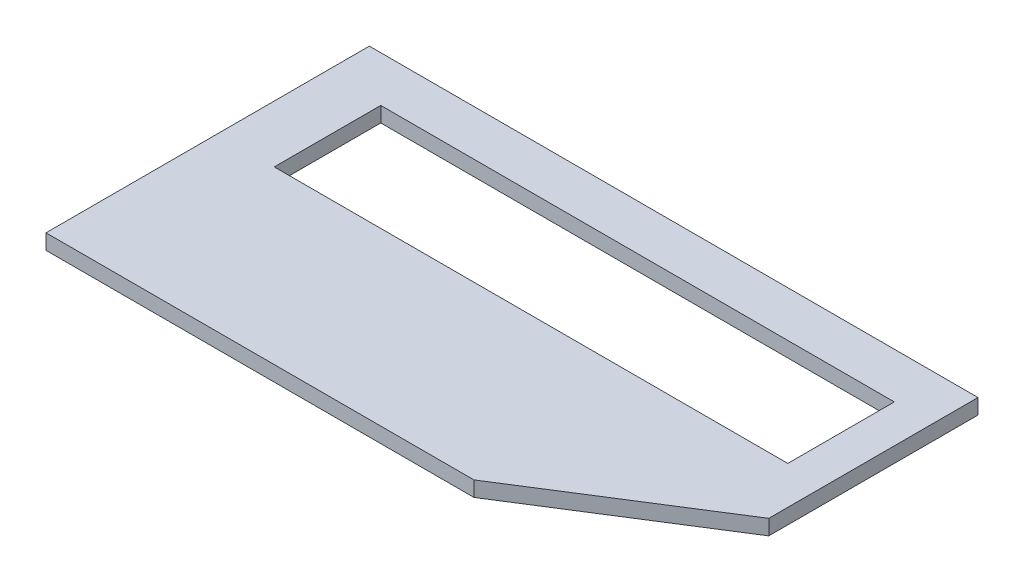
ISO-10303-21;
HEADER;
FILE_DESCRIPTION(('STEP AP214'),'2;1');
FILE_NAME('part.step','',(''),(''),'','','');
FILE_SCHEMA(('AUTOMOTIVE_DESIGN { 1 0 10303 214 1 1 1 1 }'));
ENDSEC;
DATA;
#1=APPLICATION_CONTEXT('core data for automotive mechanical design processes');
#2=APPLICATION_PROTOCOL_DEFINITION('international standard','automotive_design',2000,#1);
#3=PRODUCT_CONTEXT('',#1,'mechanical');
#4=PRODUCT('Part','Part','',(#3));
#5=PRODUCT_RELATED_PRODUCT_CATEGORY('part','',(#4));
#6=PRODUCT_DEFINITION_FORMATION('','',#4);
#7=PRODUCT_DEFINITION_CONTEXT('part definition',#1,'design');
#8=PRODUCT_DEFINITION('design','',#6,#7);
#9=PRODUCT_DEFINITION_SHAPE('','',#8);
#10=(LENGTH_UNIT() NAMED_UNIT(*) SI_UNIT(.MILLI.,.METRE.));
#11=(NAMED_UNIT(*) PLANE_ANGLE_UNIT() SI_UNIT($,.RADIAN.));
#12=(NAMED_UNIT(*) SI_UNIT($,.STERADIAN.) SOLID_ANGLE_UNIT());
#13=UNCERTAINTY_MEASURE_WITH_UNIT(LENGTH_MEASURE(1.E-05),#10,'distance_accuracy_value','');
#14=(GEOMETRIC_REPRESENTATION_CONTEXT(3) GLOBAL_UNCERTAINTY_ASSIGNED_CONTEXT((#13)) GLOBAL_UNIT_ASSIGNED_CONTEXT((#10,
#11,#12)) REPRESENTATION_CONTEXT('',''));
#15=CARTESIAN_POINT('',(0.,0.,0.));
#16=DIRECTION('',(0.,0.,1.));
#17=DIRECTION('',(1.,0.,0.));
#18=AXIS2_PLACEMENT_3D('',#15,#16,#17);
#19=CARTESIAN_POINT('',(0.,8.,0.));
#20=DIRECTION('',(0.,-1.,0.));
#21=DIRECTION('',(0.,0.,-1.));
#22=AXIS2_PLACEMENT_3D('',#19,#20,#21);
#23=PLANE('',#22);
#24=DIRECTION('',(0.,0.,1.));
#25=VECTOR('',#24,1.);
#26=CARTESIAN_POINT('',(0.,8.,0.));
#27=LINE('',#26,#25);
#28=CARTESIAN_POINT('',(0.,8.,-170.));
#29=VERTEX_POINT('',#28);
#30=CARTESIAN_POINT('',(0.,8.,0.));
#31=VERTEX_POINT('',#30);
#32=EDGE_CURVE('E159',#29,#31,#27,.T.);
#33=ORIENTED_EDGE('',*,*,#32,.T.);
#34=DIRECTION('',(1.,0.,0.));
#35=VECTOR('',#34,1.);
#36=CARTESIAN_POINT('',(0.,8.,0.));
#37=LINE('',#36,#35);
#38=CARTESIAN_POINT('',(225.,8.,0.));
#39=VERTEX_POINT('',#38);
#40=EDGE_CURVE('E163',#31,#39,#37,.T.);
#41=ORIENTED_EDGE('',*,*,#40,.T.);
#42=DIRECTION('',(0.845488903030971,0.,-0.533992991387982));
#43=VECTOR('',#42,1.);
#44=CARTESIAN_POINT('',(320.,8.,-60.));
#45=LINE('',#44,#43);
#46=CARTESIAN_POINT('',(320.,8.,-60.));
#47=VERTEX_POINT('',#46);
#48=EDGE_CURVE('E167',#39,#47,#45,.T.);
#49=ORIENTED_EDGE('',*,*,#48,.T.);
#50=DIRECTION('',(0.,0.,-1.));
#51=VECTOR('',#50,1.);
#52=CARTESIAN_POINT('',(320.,8.,-170.));
#53=LINE('',#52,#51);
#54=CARTESIAN_POINT('',(320.,8.,-170.));
#55=VERTEX_POINT('',#54);
#56=EDGE_CURVE('E170',#47,#55,#53,.T.);
#57=ORIENTED_EDGE('',*,*,#56,.T.);
#58=DIRECTION('',(-1.,0.,0.));
#59=VECTOR('',#58,1.);
#60=CARTESIAN_POINT('',(0.,8.,-170.));
#61=LINE('',#60,#59);
#62=EDGE_CURVE('E173',#55,#29,#61,.T.);
#63=ORIENTED_EDGE('',*,*,#62,.T.);
#64=EDGE_LOOP('',(#33,#41,#49,#57,#63));
#65=FACE_BOUND('',#64,.T.);
#66=DIRECTION('',(0.,0.,1.));
#67=VECTOR('',#66,1.);
#68=CARTESIAN_POINT('',(30.,8.,-146.));
#69=LINE('',#68,#67);
#70=CARTESIAN_POINT('',(30.,8.,-146.));
#71=VERTEX_POINT('',#70);
#72=CARTESIAN_POINT('',(30.,8.,-90.));
#73=VERTEX_POINT('',#72);
#74=EDGE_CURVE('E111',#71,#73,#69,.T.);
#75=ORIENTED_EDGE('',*,*,#74,.F.);
#76=DIRECTION('',(-1.,0.,0.));
#77=VECTOR('',#76,1.);
#78=CARTESIAN_POINT('',(30.,8.,-146.));
#79=LINE('',#78,#77);
#80=CARTESIAN_POINT('',(300.,8.,-146.));
#81=VERTEX_POINT('',#80);
#82=EDGE_CURVE('E137',#81,#71,#79,.T.);
#83=ORIENTED_EDGE('',*,*,#82,.F.);
#84=DIRECTION('',(0.,0.,-1.));
#85=VECTOR('',#84,1.);
#86=CARTESIAN_POINT('',(300.,8.,-146.));
#87=LINE('',#86,#85);
#88=CARTESIAN_POINT('',(300.,8.,-90.));
#89=VERTEX_POINT('',#88);
#90=EDGE_CURVE('E133',#89,#81,#87,.T.);
#91=ORIENTED_EDGE('',*,*,#90,.F.);
#92=DIRECTION('',(1.,0.,0.));
#93=VECTOR('',#92,1.);
#94=CARTESIAN_POINT('',(30.,8.,-90.));
#95=LINE('',#94,#93);
#96=EDGE_CURVE('E120',#73,#89,#95,.T.);
#97=ORIENTED_EDGE('',*,*,#96,.F.);
#98=EDGE_LOOP('',(#75,#83,#91,#97));
#99=FACE_BOUND('',#98,.T.);
#100=ADVANCED_FACE('F39',(#65,#99),#23,.F.);
#101=CARTESIAN_POINT('',(0.,0.,0.));
#102=DIRECTION('',(0.,-1.,0.));
#103=DIRECTION('',(0.,0.,-1.));
#104=AXIS2_PLACEMENT_3D('',#101,#102,#103);
#105=PLANE('',#104);
#106=DIRECTION('',(0.,0.,1.));
#107=VECTOR('',#106,1.);
#108=CARTESIAN_POINT('',(0.,0.,0.));
#109=LINE('',#108,#107);
#110=CARTESIAN_POINT('',(0.,0.,-170.));
#111=VERTEX_POINT('',#110);
#112=CARTESIAN_POINT('',(0.,0.,0.));
#113=VERTEX_POINT('',#112);
#114=EDGE_CURVE('E129',#111,#113,#109,.T.);
#115=ORIENTED_EDGE('',*,*,#114,.F.);
#116=DIRECTION('',(-1.,0.,0.));
#117=VECTOR('',#116,1.);
#118=CARTESIAN_POINT('',(0.,0.,-170.));
#119=LINE('',#118,#117);
#120=CARTESIAN_POINT('',(320.,0.,-170.));
#121=VERTEX_POINT('',#120);
#122=EDGE_CURVE('E164',#121,#111,#119,.T.);
#123=ORIENTED_EDGE('',*,*,#122,.F.);
#124=DIRECTION('',(0.,0.,-1.));
#125=VECTOR('',#124,1.);
#126=CARTESIAN_POINT('',(320.,0.,-170.));
#127=LINE('',#126,#125);
#128=CARTESIAN_POINT('',(320.,0.,-60.));
#129=VERTEX_POINT('',#128);
#130=EDGE_CURVE('E186',#129,#121,#127,.T.);
#131=ORIENTED_EDGE('',*,*,#130,.F.);
#132=DIRECTION('',(0.845488903030971,0.,-0.533992991387982));
#133=VECTOR('',#132,1.);
#134=CARTESIAN_POINT('',(320.,0.,-60.));
#135=LINE('',#134,#133);
#136=CARTESIAN_POINT('',(225.,0.,0.));
#137=VERTEX_POINT('',#136);
#138=EDGE_CURVE('E183',#137,#129,#135,.T.);
#139=ORIENTED_EDGE('',*,*,#138,.F.);
#140=DIRECTION('',(1.,0.,0.));
#141=VECTOR('',#140,1.);
#142=CARTESIAN_POINT('',(0.,0.,0.));
#143=LINE('',#142,#141);
#144=EDGE_CURVE('E180',#113,#137,#143,.T.);
#145=ORIENTED_EDGE('',*,*,#144,.F.);
#146=EDGE_LOOP('',(#115,#123,#131,#139,#145));
#147=FACE_BOUND('',#146,.T.);
#148=DIRECTION('',(-1.,0.,0.));
#149=VECTOR('',#148,1.);
#150=CARTESIAN_POINT('',(30.,0.,-146.));
#151=LINE('',#150,#149);
#152=CARTESIAN_POINT('',(300.,0.,-146.));
#153=VERTEX_POINT('',#152);
#154=CARTESIAN_POINT('',(30.,0.,-146.));
#155=VERTEX_POINT('',#154);
#156=EDGE_CURVE('E121',#153,#155,#151,.T.);
#157=ORIENTED_EDGE('',*,*,#156,.T.);
#158=DIRECTION('',(0.,0.,1.));
#159=VECTOR('',#158,1.);
#160=CARTESIAN_POINT('',(30.,0.,-146.));
#161=LINE('',#160,#159);
#162=CARTESIAN_POINT('',(30.,0.,-90.));
#163=VERTEX_POINT('',#162);
#164=EDGE_CURVE('E63',#155,#163,#161,.T.);
#165=ORIENTED_EDGE('',*,*,#164,.T.);
#166=DIRECTION('',(1.,0.,0.));
#167=VECTOR('',#166,1.);
#168=CARTESIAN_POINT('',(30.,0.,-90.));
#169=LINE('',#168,#167);
#170=CARTESIAN_POINT('',(300.,0.,-90.));
#171=VERTEX_POINT('',#170);
#172=EDGE_CURVE('E127',#163,#171,#169,.T.);
#173=ORIENTED_EDGE('',*,*,#172,.T.);
#174=DIRECTION('',(0.,0.,-1.));
#175=VECTOR('',#174,1.);
#176=CARTESIAN_POINT('',(300.,0.,-146.));
#177=LINE('',#176,#175);
#178=EDGE_CURVE('E146',#171,#153,#177,.T.);
#179=ORIENTED_EDGE('',*,*,#178,.T.);
#180=EDGE_LOOP('',(#157,#165,#173,#179));
#181=FACE_BOUND('',#180,.T.);
#182=ADVANCED_FACE('F213',(#147,#181),#105,.T.);
#183=CARTESIAN_POINT('',(0.,8.,0.));
#184=DIRECTION('',(1.,0.,0.));
#185=DIRECTION('',(0.,0.,-1.));
#186=AXIS2_PLACEMENT_3D('',#183,#184,#185);
#187=PLANE('',#186);
#188=ORIENTED_EDGE('',*,*,#114,.T.);
#189=DIRECTION('',(0.,-1.,0.));
#190=VECTOR('',#189,1.);
#191=CARTESIAN_POINT('',(0.,8.,0.));
#192=LINE('',#191,#190);
#193=EDGE_CURVE('E11',#31,#113,#192,.T.);
#194=ORIENTED_EDGE('',*,*,#193,.F.);
#195=ORIENTED_EDGE('',*,*,#32,.F.);
#196=DIRECTION('',(0.,-1.,0.));
#197=VECTOR('',#196,1.);
#198=CARTESIAN_POINT('',(0.,8.,-170.));
#199=LINE('',#198,#197);
#200=EDGE_CURVE('E176',#29,#111,#199,.T.);
#201=ORIENTED_EDGE('',*,*,#200,.T.);
#202=EDGE_LOOP('',(#188,#194,#195,#201));
#203=FACE_BOUND('',#202,.T.);
#204=ADVANCED_FACE('F41',(#203),#187,.F.);
#205=CARTESIAN_POINT('',(0.,8.,0.));
#206=DIRECTION('',(0.,0.,-1.));
#207=DIRECTION('',(-1.,0.,0.));
#208=AXIS2_PLACEMENT_3D('',#205,#206,#207);
#209=PLANE('',#208);
#210=ORIENTED_EDGE('',*,*,#144,.T.);
#211=DIRECTION('',(0.,-1.,0.));
#212=VECTOR('',#211,1.);
#213=CARTESIAN_POINT('',(225.,8.,0.));
#214=LINE('',#213,#212);
#215=EDGE_CURVE('E48',#39,#137,#214,.T.);
#216=ORIENTED_EDGE('',*,*,#215,.F.);
#217=ORIENTED_EDGE('',*,*,#40,.F.);
#218=ORIENTED_EDGE('',*,*,#193,.T.);
#219=EDGE_LOOP('',(#210,#216,#217,#218));
#220=FACE_BOUND('',#219,.T.);
#221=ADVANCED_FACE('F227',(#220),#209,.F.);
#222=CARTESIAN_POINT('',(320.,8.,-60.));
#223=DIRECTION('',(-0.533992991387982,0.,-0.845488903030971));
#224=DIRECTION('',(-0.845488903030971,0.,0.533992991387982));
#225=AXIS2_PLACEMENT_3D('',#222,#223,#224);
#226=PLANE('',#225);
#227=ORIENTED_EDGE('',*,*,#138,.T.);
#228=DIRECTION('',(0.,-1.,0.));
#229=VECTOR('',#228,1.);
#230=CARTESIAN_POINT('',(320.,8.,-60.));
#231=LINE('',#230,#229);
#232=EDGE_CURVE('E198',#47,#129,#231,.T.);
#233=ORIENTED_EDGE('',*,*,#232,.F.);
#234=ORIENTED_EDGE('',*,*,#48,.F.);
#235=ORIENTED_EDGE('',*,*,#215,.T.);
#236=EDGE_LOOP('',(#227,#233,#234,#235));
#237=FACE_BOUND('',#236,.T.);
#238=ADVANCED_FACE('F207',(#237),#226,.F.);
#239=CARTESIAN_POINT('',(320.,8.,-170.));
#240=DIRECTION('',(-1.,0.,0.));
#241=DIRECTION('',(0.,0.,1.));
#242=AXIS2_PLACEMENT_3D('',#239,#240,#241);
#243=PLANE('',#242);
#244=ORIENTED_EDGE('',*,*,#130,.T.);
#245=DIRECTION('',(0.,-1.,0.));
#246=VECTOR('',#245,1.);
#247=CARTESIAN_POINT('',(320.,8.,-170.));
#248=LINE('',#247,#246);
#249=EDGE_CURVE('E194',#55,#121,#248,.T.);
#250=ORIENTED_EDGE('',*,*,#249,.F.);
#251=ORIENTED_EDGE('',*,*,#56,.F.);
#252=ORIENTED_EDGE('',*,*,#232,.T.);
#253=EDGE_LOOP('',(#244,#250,#251,#252));
#254=FACE_BOUND('',#253,.T.);
#255=ADVANCED_FACE('F218',(#254),#243,.F.);
#256=CARTESIAN_POINT('',(0.,8.,-170.));
#257=DIRECTION('',(0.,0.,1.));
#258=DIRECTION('',(1.,0.,0.));
#259=AXIS2_PLACEMENT_3D('',#256,#257,#258);
#260=PLANE('',#259);
#261=ORIENTED_EDGE('',*,*,#122,.T.);
#262=ORIENTED_EDGE('',*,*,#200,.F.);
#263=ORIENTED_EDGE('',*,*,#62,.F.);
#264=ORIENTED_EDGE('',*,*,#249,.T.);
#265=EDGE_LOOP('',(#261,#262,#263,#264));
#266=FACE_BOUND('',#265,.T.);
#267=ADVANCED_FACE('F222',(#266),#260,.F.);
#268=CARTESIAN_POINT('',(30.,8.,-146.));
#269=DIRECTION('',(1.,0.,0.));
#270=DIRECTION('',(0.,0.,-1.));
#271=AXIS2_PLACEMENT_3D('',#268,#269,#270);
#272=PLANE('',#271);
#273=ORIENTED_EDGE('',*,*,#164,.F.);
#274=DIRECTION('',(0.,-1.,0.));
#275=VECTOR('',#274,1.);
#276=CARTESIAN_POINT('',(30.,8.,-146.));
#277=LINE('',#276,#275);
#278=EDGE_CURVE('E115',#71,#155,#277,.T.);
#279=ORIENTED_EDGE('',*,*,#278,.F.);
#280=ORIENTED_EDGE('',*,*,#74,.T.);
#281=DIRECTION('',(0.,-1.,0.));
#282=VECTOR('',#281,1.);
#283=CARTESIAN_POINT('',(30.,8.,-90.));
#284=LINE('',#283,#282);
#285=EDGE_CURVE('E114',#73,#163,#284,.T.);
#286=ORIENTED_EDGE('',*,*,#285,.T.);
#287=EDGE_LOOP('',(#273,#279,#280,#286));
#288=FACE_BOUND('',#287,.T.);
#289=ADVANCED_FACE('F113',(#288),#272,.T.);
#290=CARTESIAN_POINT('',(30.,8.,-90.));
#291=DIRECTION('',(0.,0.,-1.));
#292=DIRECTION('',(-1.,0.,0.));
#293=AXIS2_PLACEMENT_3D('',#290,#291,#292);
#294=PLANE('',#293);
#295=ORIENTED_EDGE('',*,*,#172,.F.);
#296=ORIENTED_EDGE('',*,*,#285,.F.);
#297=ORIENTED_EDGE('',*,*,#96,.T.);
#298=DIRECTION('',(0.,-1.,0.));
#299=VECTOR('',#298,1.);
#300=CARTESIAN_POINT('',(300.,8.,-90.));
#301=LINE('',#300,#299);
#302=EDGE_CURVE('E130',#89,#171,#301,.T.);
#303=ORIENTED_EDGE('',*,*,#302,.T.);
#304=EDGE_LOOP('',(#295,#296,#297,#303));
#305=FACE_BOUND('',#304,.T.);
#306=ADVANCED_FACE('F124',(#305),#294,.T.);
#307=CARTESIAN_POINT('',(300.,8.,-146.));
#308=DIRECTION('',(-1.,0.,0.));
#309=DIRECTION('',(0.,0.,1.));
#310=AXIS2_PLACEMENT_3D('',#307,#308,#309);
#311=PLANE('',#310);
#312=ORIENTED_EDGE('',*,*,#178,.F.);
#313=ORIENTED_EDGE('',*,*,#302,.F.);
#314=ORIENTED_EDGE('',*,*,#90,.T.);
#315=DIRECTION('',(0.,-1.,0.));
#316=VECTOR('',#315,1.);
#317=CARTESIAN_POINT('',(300.,8.,-146.));
#318=LINE('',#317,#316);
#319=EDGE_CURVE('E55',#81,#153,#318,.T.);
#320=ORIENTED_EDGE('',*,*,#319,.T.);
#321=EDGE_LOOP('',(#312,#313,#314,#320));
#322=FACE_BOUND('',#321,.T.);
#323=ADVANCED_FACE('F270',(#322),#311,.T.);
#324=CARTESIAN_POINT('',(30.,8.,-146.));
#325=DIRECTION('',(0.,0.,1.));
#326=DIRECTION('',(1.,0.,0.));
#327=AXIS2_PLACEMENT_3D('',#324,#325,#326);
#328=PLANE('',#327);
#329=ORIENTED_EDGE('',*,*,#156,.F.);
#330=ORIENTED_EDGE('',*,*,#319,.F.);
#331=ORIENTED_EDGE('',*,*,#82,.T.);
#332=ORIENTED_EDGE('',*,*,#278,.T.);
#333=EDGE_LOOP('',(#329,#330,#331,#332));
#334=FACE_BOUND('',#333,.T.);
#335=ADVANCED_FACE('F276',(#334),#328,.T.);
#336=CLOSED_SHELL('',(#100,#182,#204,#221,#238,#255,#267,#289,#306,#323,#335));
#337=MANIFOLD_SOLID_BREP('B2',#336);
#338=ADVANCED_BREP_SHAPE_REPRESENTATION('',(#18,#337),#14);
#339=SHAPE_DEFINITION_REPRESENTATION(#9,#338);
ENDSEC;
END-ISO-10303-21;
